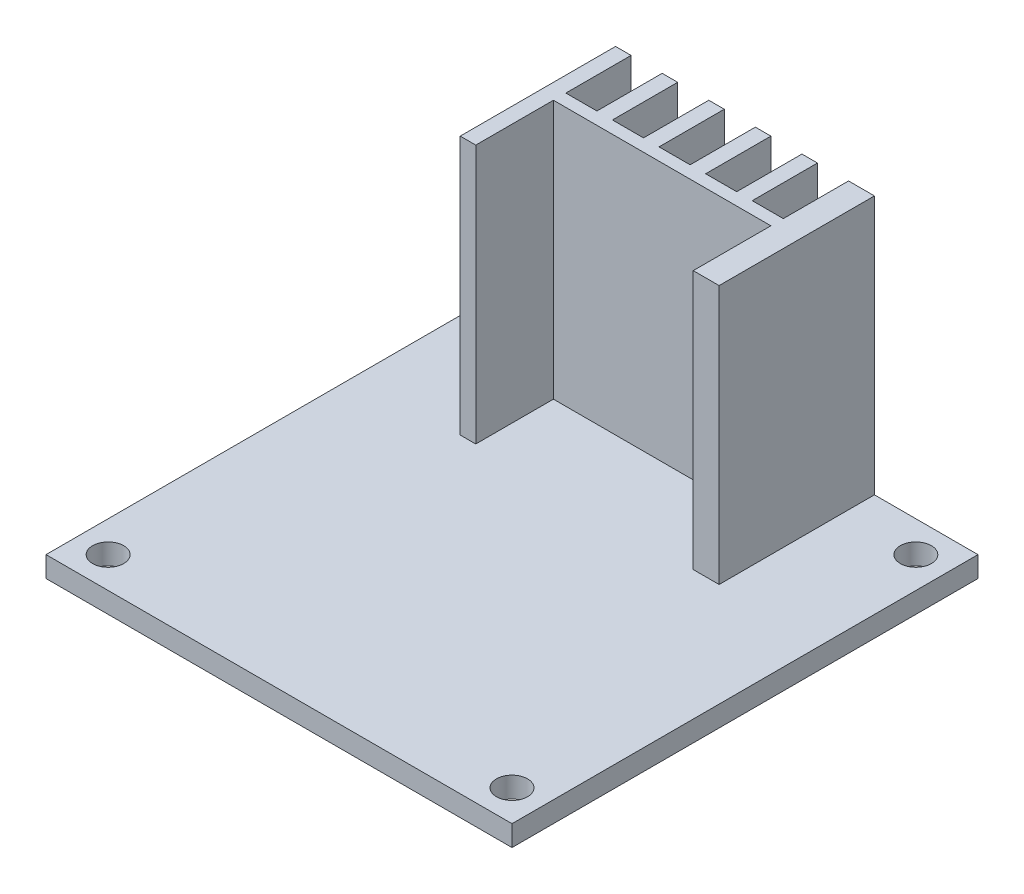
ISO-10303-21;
HEADER;
FILE_DESCRIPTION(('STEP AP214'),'2;1');
FILE_NAME('part.step','',(''),(''),'','','');
FILE_SCHEMA(('AUTOMOTIVE_DESIGN { 1 0 10303 214 1 1 1 1 }'));
ENDSEC;
DATA;
#1=APPLICATION_CONTEXT('core data for automotive mechanical design processes');
#2=APPLICATION_PROTOCOL_DEFINITION('international standard','automotive_design',2000,#1);
#3=PRODUCT_CONTEXT('',#1,'mechanical');
#4=PRODUCT('Part','Part','',(#3));
#5=PRODUCT_RELATED_PRODUCT_CATEGORY('part','',(#4));
#6=PRODUCT_DEFINITION_FORMATION('','',#4);
#7=PRODUCT_DEFINITION_CONTEXT('part definition',#1,'design');
#8=PRODUCT_DEFINITION('design','',#6,#7);
#9=PRODUCT_DEFINITION_SHAPE('','',#8);
#10=(LENGTH_UNIT() NAMED_UNIT(*) SI_UNIT(.MILLI.,.METRE.));
#11=(NAMED_UNIT(*) PLANE_ANGLE_UNIT() SI_UNIT($,.RADIAN.));
#12=(NAMED_UNIT(*) SI_UNIT($,.STERADIAN.) SOLID_ANGLE_UNIT());
#13=UNCERTAINTY_MEASURE_WITH_UNIT(LENGTH_MEASURE(1.E-05),#10,'distance_accuracy_value','');
#14=(GEOMETRIC_REPRESENTATION_CONTEXT(3) GLOBAL_UNCERTAINTY_ASSIGNED_CONTEXT((#13)) GLOBAL_UNIT_ASSIGNED_CONTEXT((#10,
#11,#12)) REPRESENTATION_CONTEXT('',''));
#15=CARTESIAN_POINT('',(0.,0.,0.));
#16=DIRECTION('',(0.,0.,1.));
#17=DIRECTION('',(1.,0.,0.));
#18=AXIS2_PLACEMENT_3D('',#15,#16,#17);
#19=CARTESIAN_POINT('',(22.5,2.,-22.5));
#20=DIRECTION('',(0.,0.,1.));
#21=DIRECTION('',(1.,0.,0.));
#22=AXIS2_PLACEMENT_3D('',#19,#20,#21);
#23=PLANE('',#22);
#24=DIRECTION('',(1.,0.,0.));
#25=VECTOR('',#24,1.);
#26=CARTESIAN_POINT('',(22.5,2.,-22.5));
#27=LINE('',#26,#25);
#28=CARTESIAN_POINT('',(-12.5,2.,-22.5));
#29=VERTEX_POINT('',#28);
#30=CARTESIAN_POINT('',(-11.,2.,-22.5));
#31=VERTEX_POINT('',#30);
#32=EDGE_CURVE('E11',#29,#31,#27,.T.);
#33=ORIENTED_EDGE('',*,*,#32,.F.);
#34=DIRECTION('',(0.,-1.,0.));
#35=VECTOR('',#34,1.);
#36=CARTESIAN_POINT('',(-12.5,27.,-22.5));
#37=LINE('',#36,#35);
#38=CARTESIAN_POINT('',(-12.5,27.,-22.5));
#39=VERTEX_POINT('',#38);
#40=EDGE_CURVE('E703',#39,#29,#37,.T.);
#41=ORIENTED_EDGE('',*,*,#40,.F.);
#42=DIRECTION('',(-1.,0.,0.));
#43=VECTOR('',#42,1.);
#44=CARTESIAN_POINT('',(0.,27.,-22.5));
#45=LINE('',#44,#43);
#46=CARTESIAN_POINT('',(-11.,27.,-22.5));
#47=VERTEX_POINT('',#46);
#48=EDGE_CURVE('E290',#47,#39,#45,.T.);
#49=ORIENTED_EDGE('',*,*,#48,.F.);
#50=DIRECTION('',(0.,-1.,0.));
#51=VECTOR('',#50,1.);
#52=CARTESIAN_POINT('',(-11.,27.,-22.5));
#53=LINE('',#52,#51);
#54=EDGE_CURVE('E452',#47,#31,#53,.T.);
#55=ORIENTED_EDGE('',*,*,#54,.T.);
#56=EDGE_LOOP('',(#33,#41,#49,#55));
#57=FACE_BOUND('',#56,.T.);
#58=ADVANCED_FACE('F38',(#57),#23,.F.);
#59=CARTESIAN_POINT('',(-7.99999999999999,2.,-22.5));
#60=VERTEX_POINT('',#59);
#61=CARTESIAN_POINT('',(-6.49999999999998,2.,-22.5));
#62=VERTEX_POINT('',#61);
#63=EDGE_CURVE('E48',#60,#62,#27,.T.);
#64=ORIENTED_EDGE('',*,*,#63,.F.);
#65=DIRECTION('',(0.,-1.,0.));
#66=VECTOR('',#65,1.);
#67=CARTESIAN_POINT('',(-8.,27.,-22.5));
#68=LINE('',#67,#66);
#69=CARTESIAN_POINT('',(-8.,27.,-22.5));
#70=VERTEX_POINT('',#69);
#71=EDGE_CURVE('E416',#70,#60,#68,.T.);
#72=ORIENTED_EDGE('',*,*,#71,.F.);
#73=CARTESIAN_POINT('',(-6.5,27.,-22.5));
#74=VERTEX_POINT('',#73);
#75=EDGE_CURVE('E329',#74,#70,#45,.T.);
#76=ORIENTED_EDGE('',*,*,#75,.F.);
#77=DIRECTION('',(0.,-1.,0.));
#78=VECTOR('',#77,1.);
#79=CARTESIAN_POINT('',(-6.5,27.,-22.5));
#80=LINE('',#79,#78);
#81=EDGE_CURVE('E411',#74,#62,#80,.T.);
#82=ORIENTED_EDGE('',*,*,#81,.T.);
#83=EDGE_LOOP('',(#64,#72,#76,#82));
#84=FACE_BOUND('',#83,.T.);
#85=ADVANCED_FACE('F412',(#84),#23,.F.);
#86=CARTESIAN_POINT('',(-3.49999999999999,2.,-22.5));
#87=VERTEX_POINT('',#86);
#88=CARTESIAN_POINT('',(-1.99999999999998,2.,-22.5));
#89=VERTEX_POINT('',#88);
#90=EDGE_CURVE('E381',#87,#89,#27,.T.);
#91=ORIENTED_EDGE('',*,*,#90,.F.);
#92=DIRECTION('',(0.,-1.,0.));
#93=VECTOR('',#92,1.);
#94=CARTESIAN_POINT('',(-3.5,27.,-22.5));
#95=LINE('',#94,#93);
#96=CARTESIAN_POINT('',(-3.5,27.,-22.5));
#97=VERTEX_POINT('',#96);
#98=EDGE_CURVE('E458',#97,#87,#95,.T.);
#99=ORIENTED_EDGE('',*,*,#98,.F.);
#100=CARTESIAN_POINT('',(-2.,27.,-22.5));
#101=VERTEX_POINT('',#100);
#102=EDGE_CURVE('E319',#101,#97,#45,.T.);
#103=ORIENTED_EDGE('',*,*,#102,.F.);
#104=DIRECTION('',(0.,-1.,0.));
#105=VECTOR('',#104,1.);
#106=CARTESIAN_POINT('',(-2.,27.,-22.5));
#107=LINE('',#106,#105);
#108=EDGE_CURVE('E463',#101,#89,#107,.T.);
#109=ORIENTED_EDGE('',*,*,#108,.T.);
#110=EDGE_LOOP('',(#91,#99,#103,#109));
#111=FACE_BOUND('',#110,.T.);
#112=ADVANCED_FACE('F609',(#111),#23,.F.);
#113=CARTESIAN_POINT('',(1.00000000000001,2.,-22.5));
#114=VERTEX_POINT('',#113);
#115=CARTESIAN_POINT('',(2.50000000000002,2.,-22.5));
#116=VERTEX_POINT('',#115);
#117=EDGE_CURVE('E378',#114,#116,#27,.T.);
#118=ORIENTED_EDGE('',*,*,#117,.F.);
#119=DIRECTION('',(0.,-1.,0.));
#120=VECTOR('',#119,1.);
#121=CARTESIAN_POINT('',(1.,27.,-22.5));
#122=LINE('',#121,#120);
#123=CARTESIAN_POINT('',(1.,27.,-22.5));
#124=VERTEX_POINT('',#123);
#125=EDGE_CURVE('E466',#124,#114,#122,.T.);
#126=ORIENTED_EDGE('',*,*,#125,.F.);
#127=CARTESIAN_POINT('',(2.5,27.,-22.5));
#128=VERTEX_POINT('',#127);
#129=EDGE_CURVE('E309',#128,#124,#45,.T.);
#130=ORIENTED_EDGE('',*,*,#129,.F.);
#131=DIRECTION('',(0.,-1.,0.));
#132=VECTOR('',#131,1.);
#133=CARTESIAN_POINT('',(2.5,27.,-22.5));
#134=LINE('',#133,#132);
#135=EDGE_CURVE('E471',#128,#116,#134,.T.);
#136=ORIENTED_EDGE('',*,*,#135,.T.);
#137=EDGE_LOOP('',(#118,#126,#130,#136));
#138=FACE_BOUND('',#137,.T.);
#139=ADVANCED_FACE('F629',(#138),#23,.F.);
#140=CARTESIAN_POINT('',(5.50000000000002,2.,-22.5));
#141=VERTEX_POINT('',#140);
#142=CARTESIAN_POINT('',(7.00000000000001,2.,-22.5));
#143=VERTEX_POINT('',#142);
#144=EDGE_CURVE('E374',#141,#143,#27,.T.);
#145=ORIENTED_EDGE('',*,*,#144,.F.);
#146=DIRECTION('',(0.,-1.,0.));
#147=VECTOR('',#146,1.);
#148=CARTESIAN_POINT('',(5.5,27.,-22.5));
#149=LINE('',#148,#147);
#150=CARTESIAN_POINT('',(5.5,27.,-22.5));
#151=VERTEX_POINT('',#150);
#152=EDGE_CURVE('E474',#151,#141,#149,.T.);
#153=ORIENTED_EDGE('',*,*,#152,.F.);
#154=CARTESIAN_POINT('',(7.,27.,-22.5));
#155=VERTEX_POINT('',#154);
#156=EDGE_CURVE('E291',#155,#151,#45,.T.);
#157=ORIENTED_EDGE('',*,*,#156,.F.);
#158=DIRECTION('',(0.,-1.,0.));
#159=VECTOR('',#158,1.);
#160=CARTESIAN_POINT('',(7.,27.,-22.5));
#161=LINE('',#160,#159);
#162=EDGE_CURVE('E479',#155,#143,#161,.T.);
#163=ORIENTED_EDGE('',*,*,#162,.T.);
#164=EDGE_LOOP('',(#145,#153,#157,#163));
#165=FACE_BOUND('',#164,.T.);
#166=ADVANCED_FACE('F622',(#165),#23,.F.);
#167=CARTESIAN_POINT('',(10.,2.,-22.5));
#168=VERTEX_POINT('',#167);
#169=CARTESIAN_POINT('',(12.5,2.,-22.5));
#170=VERTEX_POINT('',#169);
#171=EDGE_CURVE('E371',#168,#170,#27,.T.);
#172=ORIENTED_EDGE('',*,*,#171,.F.);
#173=DIRECTION('',(0.,-1.,0.));
#174=VECTOR('',#173,1.);
#175=CARTESIAN_POINT('',(10.,27.,-22.5));
#176=LINE('',#175,#174);
#177=CARTESIAN_POINT('',(10.,27.,-22.5));
#178=VERTEX_POINT('',#177);
#179=EDGE_CURVE('E368',#178,#168,#176,.T.);
#180=ORIENTED_EDGE('',*,*,#179,.F.);
#181=CARTESIAN_POINT('',(12.5,27.,-22.5));
#182=VERTEX_POINT('',#181);
#183=EDGE_CURVE('E287',#182,#178,#45,.T.);
#184=ORIENTED_EDGE('',*,*,#183,.F.);
#185=DIRECTION('',(0.,-1.,0.));
#186=VECTOR('',#185,1.);
#187=CARTESIAN_POINT('',(12.5,27.,-22.5));
#188=LINE('',#187,#186);
#189=EDGE_CURVE('E364',#182,#170,#188,.T.);
#190=ORIENTED_EDGE('',*,*,#189,.T.);
#191=EDGE_LOOP('',(#172,#180,#184,#190));
#192=FACE_BOUND('',#191,.T.);
#193=ADVANCED_FACE('F613',(#192),#23,.F.);
#194=CARTESIAN_POINT('',(0.,2.,0.));
#195=DIRECTION('',(0.,1.,0.));
#196=DIRECTION('',(0.,0.,1.));
#197=AXIS2_PLACEMENT_3D('',#194,#195,#196);
#198=PLANE('',#197);
#199=DIRECTION('',(-1.,0.,0.));
#200=VECTOR('',#199,1.);
#201=CARTESIAN_POINT('',(22.5,2.,-22.5));
#202=LINE('',#201,#200);
#203=EDGE_CURVE('E395',#60,#31,#202,.T.);
#204=ORIENTED_EDGE('',*,*,#203,.T.);
#205=DIRECTION('',(0.,0.,1.));
#206=VECTOR('',#205,1.);
#207=CARTESIAN_POINT('',(-11.,2.,0.));
#208=LINE('',#207,#206);
#209=CARTESIAN_POINT('',(-11.,2.,-16.2));
#210=VERTEX_POINT('',#209);
#211=EDGE_CURVE('E55',#31,#210,#208,.T.);
#212=ORIENTED_EDGE('',*,*,#211,.T.);
#213=DIRECTION('',(1.,0.,0.));
#214=VECTOR('',#213,1.);
#215=CARTESIAN_POINT('',(0.,2.,-16.2));
#216=LINE('',#215,#214);
#217=CARTESIAN_POINT('',(-8.,2.,-16.2));
#218=VERTEX_POINT('',#217);
#219=EDGE_CURVE('E60',#210,#218,#216,.T.);
#220=ORIENTED_EDGE('',*,*,#219,.T.);
#221=DIRECTION('',(0.,0.,-1.));
#222=VECTOR('',#221,1.);
#223=CARTESIAN_POINT('',(-8.,2.,0.));
#224=LINE('',#223,#222);
#225=EDGE_CURVE('E420',#218,#60,#224,.T.);
#226=ORIENTED_EDGE('',*,*,#225,.T.);
#227=EDGE_LOOP('',(#204,#212,#220,#226));
#228=FACE_BOUND('',#227,.T.);
#229=ADVANCED_FACE('F621',(#228),#198,.T.);
#230=EDGE_CURVE('E393',#87,#62,#202,.T.);
#231=ORIENTED_EDGE('',*,*,#230,.T.);
#232=DIRECTION('',(0.,0.,1.));
#233=VECTOR('',#232,1.);
#234=CARTESIAN_POINT('',(-6.5,2.,0.));
#235=LINE('',#234,#233);
#236=CARTESIAN_POINT('',(-6.5,2.,-16.2));
#237=VERTEX_POINT('',#236);
#238=EDGE_CURVE('E404',#62,#237,#235,.T.);
#239=ORIENTED_EDGE('',*,*,#238,.T.);
#240=DIRECTION('',(1.,0.,0.));
#241=VECTOR('',#240,1.);
#242=CARTESIAN_POINT('',(0.,2.,-16.2));
#243=LINE('',#242,#241);
#244=CARTESIAN_POINT('',(-3.5,2.,-16.2));
#245=VERTEX_POINT('',#244);
#246=EDGE_CURVE('E421',#237,#245,#243,.T.);
#247=ORIENTED_EDGE('',*,*,#246,.T.);
#248=DIRECTION('',(0.,0.,-1.));
#249=VECTOR('',#248,1.);
#250=CARTESIAN_POINT('',(-3.5,2.,0.));
#251=LINE('',#250,#249);
#252=EDGE_CURVE('E407',#245,#87,#251,.T.);
#253=ORIENTED_EDGE('',*,*,#252,.T.);
#254=EDGE_LOOP('',(#231,#239,#247,#253));
#255=FACE_BOUND('',#254,.T.);
#256=ADVANCED_FACE('F402',(#255),#198,.T.);
#257=EDGE_CURVE('E408',#114,#89,#202,.T.);
#258=ORIENTED_EDGE('',*,*,#257,.T.);
#259=DIRECTION('',(0.,0.,1.));
#260=VECTOR('',#259,1.);
#261=CARTESIAN_POINT('',(-2.,2.,0.));
#262=LINE('',#261,#260);
#263=CARTESIAN_POINT('',(-2.,2.,-16.2));
#264=VERTEX_POINT('',#263);
#265=EDGE_CURVE('E955',#89,#264,#262,.T.);
#266=ORIENTED_EDGE('',*,*,#265,.T.);
#267=DIRECTION('',(1.,0.,0.));
#268=VECTOR('',#267,1.);
#269=CARTESIAN_POINT('',(0.,2.,-16.2));
#270=LINE('',#269,#268);
#271=CARTESIAN_POINT('',(1.,2.,-16.2));
#272=VERTEX_POINT('',#271);
#273=EDGE_CURVE('E665',#264,#272,#270,.T.);
#274=ORIENTED_EDGE('',*,*,#273,.T.);
#275=DIRECTION('',(0.,0.,-1.));
#276=VECTOR('',#275,1.);
#277=CARTESIAN_POINT('',(1.,2.,0.));
#278=LINE('',#277,#276);
#279=EDGE_CURVE('E669',#272,#114,#278,.T.);
#280=ORIENTED_EDGE('',*,*,#279,.T.);
#281=EDGE_LOOP('',(#258,#266,#274,#280));
#282=FACE_BOUND('',#281,.T.);
#283=ADVANCED_FACE('F944',(#282),#198,.T.);
#284=EDGE_CURVE('E541',#141,#116,#202,.T.);
#285=ORIENTED_EDGE('',*,*,#284,.T.);
#286=DIRECTION('',(0.,0.,1.));
#287=VECTOR('',#286,1.);
#288=CARTESIAN_POINT('',(2.50000000000001,2.,0.));
#289=LINE('',#288,#287);
#290=CARTESIAN_POINT('',(2.5,2.,-16.2));
#291=VERTEX_POINT('',#290);
#292=EDGE_CURVE('E662',#116,#291,#289,.T.);
#293=ORIENTED_EDGE('',*,*,#292,.T.);
#294=DIRECTION('',(1.,0.,0.));
#295=VECTOR('',#294,1.);
#296=CARTESIAN_POINT('',(0.,2.,-16.2));
#297=LINE('',#296,#295);
#298=CARTESIAN_POINT('',(5.5,2.,-16.2));
#299=VERTEX_POINT('',#298);
#300=EDGE_CURVE('E660',#291,#299,#297,.T.);
#301=ORIENTED_EDGE('',*,*,#300,.T.);
#302=DIRECTION('',(0.,0.,-1.));
#303=VECTOR('',#302,1.);
#304=CARTESIAN_POINT('',(5.5,2.,0.));
#305=LINE('',#304,#303);
#306=EDGE_CURVE('E655',#299,#141,#305,.T.);
#307=ORIENTED_EDGE('',*,*,#306,.T.);
#308=EDGE_LOOP('',(#285,#293,#301,#307));
#309=FACE_BOUND('',#308,.T.);
#310=ADVANCED_FACE('F978',(#309),#198,.T.);
#311=EDGE_CURVE('E538',#168,#143,#202,.T.);
#312=ORIENTED_EDGE('',*,*,#311,.T.);
#313=DIRECTION('',(0.,0.,1.));
#314=VECTOR('',#313,1.);
#315=CARTESIAN_POINT('',(7.,2.,0.));
#316=LINE('',#315,#314);
#317=CARTESIAN_POINT('',(7.,2.,-16.2));
#318=VERTEX_POINT('',#317);
#319=EDGE_CURVE('E653',#143,#318,#316,.T.);
#320=ORIENTED_EDGE('',*,*,#319,.T.);
#321=DIRECTION('',(1.,0.,0.));
#322=VECTOR('',#321,1.);
#323=CARTESIAN_POINT('',(0.,2.,-16.2));
#324=LINE('',#323,#322);
#325=CARTESIAN_POINT('',(10.,2.,-16.2));
#326=VERTEX_POINT('',#325);
#327=EDGE_CURVE('E355',#318,#326,#324,.T.);
#328=ORIENTED_EDGE('',*,*,#327,.T.);
#329=DIRECTION('',(0.,0.,-1.));
#330=VECTOR('',#329,1.);
#331=CARTESIAN_POINT('',(10.,2.,0.));
#332=LINE('',#331,#330);
#333=EDGE_CURVE('E361',#326,#168,#332,.T.);
#334=ORIENTED_EDGE('',*,*,#333,.T.);
#335=EDGE_LOOP('',(#312,#320,#328,#334));
#336=FACE_BOUND('',#335,.T.);
#337=ADVANCED_FACE('F642',(#336),#198,.T.);
#338=CARTESIAN_POINT('',(-19.5,2.,19.5));
#339=DIRECTION('',(0.,1.,0.));
#340=DIRECTION('',(0.,0.,1.));
#341=AXIS2_PLACEMENT_3D('',#338,#339,#340);
#342=CIRCLE('',#341,1.5);
#343=CARTESIAN_POINT('',(-19.5,2.,21.));
#344=VERTEX_POINT('',#343);
#345=EDGE_CURVE('E497',#344,#344,#342,.T.);
#346=ORIENTED_EDGE('',*,*,#345,.F.);
#347=EDGE_LOOP('',(#346));
#348=FACE_BOUND('',#347,.T.);
#349=CARTESIAN_POINT('',(-19.5,2.,-19.5));
#350=DIRECTION('',(0.,1.,0.));
#351=DIRECTION('',(0.,0.,1.));
#352=AXIS2_PLACEMENT_3D('',#349,#350,#351);
#353=CIRCLE('',#352,1.5);
#354=CARTESIAN_POINT('',(-19.5,2.,-18.));
#355=VERTEX_POINT('',#354);
#356=EDGE_CURVE('E509',#355,#355,#353,.T.);
#357=ORIENTED_EDGE('',*,*,#356,.F.);
#358=EDGE_LOOP('',(#357));
#359=FACE_BOUND('',#358,.T.);
#360=CARTESIAN_POINT('',(19.5,2.,-19.5));
#361=DIRECTION('',(0.,1.,0.));
#362=DIRECTION('',(0.,0.,1.));
#363=AXIS2_PLACEMENT_3D('',#360,#361,#362);
#364=CIRCLE('',#363,1.5);
#365=CARTESIAN_POINT('',(19.5,2.,-18.));
#366=VERTEX_POINT('',#365);
#367=EDGE_CURVE('E503',#366,#366,#364,.T.);
#368=ORIENTED_EDGE('',*,*,#367,.F.);
#369=EDGE_LOOP('',(#368));
#370=FACE_BOUND('',#369,.T.);
#371=CARTESIAN_POINT('',(19.5,2.,19.5));
#372=DIRECTION('',(0.,1.,0.));
#373=DIRECTION('',(0.,0.,1.));
#374=AXIS2_PLACEMENT_3D('',#371,#372,#373);
#375=CIRCLE('',#374,1.5);
#376=CARTESIAN_POINT('',(19.5,2.,21.));
#377=VERTEX_POINT('',#376);
#378=EDGE_CURVE('E491',#377,#377,#375,.T.);
#379=ORIENTED_EDGE('',*,*,#378,.F.);
#380=EDGE_LOOP('',(#379));
#381=FACE_BOUND('',#380,.T.);
#382=DIRECTION('',(-1.,0.,0.));
#383=VECTOR('',#382,1.);
#384=CARTESIAN_POINT('',(0.,2.,-7.5));
#385=LINE('',#384,#383);
#386=CARTESIAN_POINT('',(-11.,2.,-7.5));
#387=VERTEX_POINT('',#386);
#388=CARTESIAN_POINT('',(-12.5,2.,-7.5));
#389=VERTEX_POINT('',#388);
#390=EDGE_CURVE('E257',#387,#389,#385,.T.);
#391=ORIENTED_EDGE('',*,*,#390,.T.);
#392=DIRECTION('',(0.,0.,-1.));
#393=VECTOR('',#392,1.);
#394=CARTESIAN_POINT('',(-12.5,2.,0.));
#395=LINE('',#394,#393);
#396=EDGE_CURVE('E274',#389,#29,#395,.T.);
#397=ORIENTED_EDGE('',*,*,#396,.T.);
#398=CARTESIAN_POINT('',(-22.5,2.,-22.5));
#399=VERTEX_POINT('',#398);
#400=EDGE_CURVE('E523',#29,#399,#202,.T.);
#401=ORIENTED_EDGE('',*,*,#400,.T.);
#402=DIRECTION('',(0.,0.,1.));
#403=VECTOR('',#402,1.);
#404=CARTESIAN_POINT('',(-22.5,2.,22.5));
#405=LINE('',#404,#403);
#406=CARTESIAN_POINT('',(-22.5,2.,22.5));
#407=VERTEX_POINT('',#406);
#408=EDGE_CURVE('E515',#399,#407,#405,.T.);
#409=ORIENTED_EDGE('',*,*,#408,.T.);
#410=DIRECTION('',(1.,0.,0.));
#411=VECTOR('',#410,1.);
#412=CARTESIAN_POINT('',(22.5,2.,22.5));
#413=LINE('',#412,#411);
#414=CARTESIAN_POINT('',(22.5,2.,22.5));
#415=VERTEX_POINT('',#414);
#416=EDGE_CURVE('E518',#407,#415,#413,.T.);
#417=ORIENTED_EDGE('',*,*,#416,.T.);
#418=DIRECTION('',(0.,0.,-1.));
#419=VECTOR('',#418,1.);
#420=CARTESIAN_POINT('',(22.5,2.,22.5));
#421=LINE('',#420,#419);
#422=CARTESIAN_POINT('',(22.5,2.,-22.5));
#423=VERTEX_POINT('',#422);
#424=EDGE_CURVE('E521',#415,#423,#421,.T.);
#425=ORIENTED_EDGE('',*,*,#424,.T.);
#426=EDGE_CURVE('E534',#423,#170,#202,.T.);
#427=ORIENTED_EDGE('',*,*,#426,.T.);
#428=DIRECTION('',(0.,0.,-1.));
#429=VECTOR('',#428,1.);
#430=CARTESIAN_POINT('',(12.5,2.,0.));
#431=LINE('',#430,#429);
#432=CARTESIAN_POINT('',(12.5,2.,-7.50000000000001));
#433=VERTEX_POINT('',#432);
#434=EDGE_CURVE('E352',#433,#170,#431,.T.);
#435=ORIENTED_EDGE('',*,*,#434,.F.);
#436=DIRECTION('',(-1.,0.,0.));
#437=VECTOR('',#436,1.);
#438=CARTESIAN_POINT('',(0.,2.,-7.50000000000001));
#439=LINE('',#438,#437);
#440=CARTESIAN_POINT('',(10.,2.,-7.50000000000001));
#441=VERTEX_POINT('',#440);
#442=EDGE_CURVE('E350',#433,#441,#439,.T.);
#443=ORIENTED_EDGE('',*,*,#442,.T.);
#444=DIRECTION('',(0.,0.,1.));
#445=VECTOR('',#444,1.);
#446=CARTESIAN_POINT('',(10.,2.,0.));
#447=LINE('',#446,#445);
#448=CARTESIAN_POINT('',(10.,2.,-15.));
#449=VERTEX_POINT('',#448);
#450=EDGE_CURVE('E347',#449,#441,#447,.T.);
#451=ORIENTED_EDGE('',*,*,#450,.F.);
#452=DIRECTION('',(1.,0.,0.));
#453=VECTOR('',#452,1.);
#454=CARTESIAN_POINT('',(0.,2.,-15.));
#455=LINE('',#454,#453);
#456=CARTESIAN_POINT('',(-11.,2.,-15.));
#457=VERTEX_POINT('',#456);
#458=EDGE_CURVE('E344',#457,#449,#455,.T.);
#459=ORIENTED_EDGE('',*,*,#458,.F.);
#460=DIRECTION('',(0.,0.,-1.));
#461=VECTOR('',#460,1.);
#462=CARTESIAN_POINT('',(-11.,2.,0.));
#463=LINE('',#462,#461);
#464=EDGE_CURVE('E342',#387,#457,#463,.T.);
#465=ORIENTED_EDGE('',*,*,#464,.F.);
#466=EDGE_LOOP('',(#391,#397,#401,#409,#417,#425,#427,#435,#443,#451,#459,#465));
#467=FACE_BOUND('',#466,.T.);
#468=ADVANCED_FACE('F546',(#348,#359,#370,#381,#467),#198,.T.);
#469=CARTESIAN_POINT('',(0.,0.,0.));
#470=DIRECTION('',(0.,1.,0.));
#471=DIRECTION('',(0.,0.,1.));
#472=AXIS2_PLACEMENT_3D('',#469,#470,#471);
#473=PLANE('',#472);
#474=DIRECTION('',(0.,0.,1.));
#475=VECTOR('',#474,1.);
#476=CARTESIAN_POINT('',(-22.5,0.,22.5));
#477=LINE('',#476,#475);
#478=CARTESIAN_POINT('',(-22.5,0.,-22.5));
#479=VERTEX_POINT('',#478);
#480=CARTESIAN_POINT('',(-22.5,0.,22.5));
#481=VERTEX_POINT('',#480);
#482=EDGE_CURVE('E512',#479,#481,#477,.T.);
#483=ORIENTED_EDGE('',*,*,#482,.F.);
#484=DIRECTION('',(-1.,0.,0.));
#485=VECTOR('',#484,1.);
#486=CARTESIAN_POINT('',(22.5,0.,-22.5));
#487=LINE('',#486,#485);
#488=CARTESIAN_POINT('',(22.5,0.,-22.5));
#489=VERTEX_POINT('',#488);
#490=EDGE_CURVE('E519',#489,#479,#487,.T.);
#491=ORIENTED_EDGE('',*,*,#490,.F.);
#492=DIRECTION('',(0.,0.,-1.));
#493=VECTOR('',#492,1.);
#494=CARTESIAN_POINT('',(22.5,0.,22.5));
#495=LINE('',#494,#493);
#496=CARTESIAN_POINT('',(22.5,0.,22.5));
#497=VERTEX_POINT('',#496);
#498=EDGE_CURVE('E568',#497,#489,#495,.T.);
#499=ORIENTED_EDGE('',*,*,#498,.F.);
#500=DIRECTION('',(1.,0.,0.));
#501=VECTOR('',#500,1.);
#502=CARTESIAN_POINT('',(22.5,0.,22.5));
#503=LINE('',#502,#501);
#504=EDGE_CURVE('E569',#481,#497,#503,.T.);
#505=ORIENTED_EDGE('',*,*,#504,.F.);
#506=EDGE_LOOP('',(#483,#491,#499,#505));
#507=FACE_BOUND('',#506,.T.);
#508=CARTESIAN_POINT('',(-19.5,0.,-19.5));
#509=DIRECTION('',(0.,1.,0.));
#510=DIRECTION('',(0.,0.,1.));
#511=AXIS2_PLACEMENT_3D('',#508,#509,#510);
#512=CIRCLE('',#511,1.5);
#513=CARTESIAN_POINT('',(-19.5,0.,-18.));
#514=VERTEX_POINT('',#513);
#515=EDGE_CURVE('E506',#514,#514,#512,.T.);
#516=ORIENTED_EDGE('',*,*,#515,.T.);
#517=EDGE_LOOP('',(#516));
#518=FACE_BOUND('',#517,.T.);
#519=CARTESIAN_POINT('',(19.5,0.,-19.5));
#520=DIRECTION('',(0.,1.,0.));
#521=DIRECTION('',(0.,0.,1.));
#522=AXIS2_PLACEMENT_3D('',#519,#520,#521);
#523=CIRCLE('',#522,1.5);
#524=CARTESIAN_POINT('',(19.5,0.,-18.));
#525=VERTEX_POINT('',#524);
#526=EDGE_CURVE('E500',#525,#525,#523,.T.);
#527=ORIENTED_EDGE('',*,*,#526,.T.);
#528=EDGE_LOOP('',(#527));
#529=FACE_BOUND('',#528,.T.);
#530=CARTESIAN_POINT('',(-19.5,0.,19.5));
#531=DIRECTION('',(0.,1.,0.));
#532=DIRECTION('',(0.,0.,1.));
#533=AXIS2_PLACEMENT_3D('',#530,#531,#532);
#534=CIRCLE('',#533,1.5);
#535=CARTESIAN_POINT('',(-19.5,0.,21.));
#536=VERTEX_POINT('',#535);
#537=EDGE_CURVE('E494',#536,#536,#534,.T.);
#538=ORIENTED_EDGE('',*,*,#537,.T.);
#539=EDGE_LOOP('',(#538));
#540=FACE_BOUND('',#539,.T.);
#541=CARTESIAN_POINT('',(19.5,0.,19.5));
#542=DIRECTION('',(0.,1.,0.));
#543=DIRECTION('',(0.,0.,1.));
#544=AXIS2_PLACEMENT_3D('',#541,#542,#543);
#545=CIRCLE('',#544,1.5);
#546=CARTESIAN_POINT('',(19.5,0.,21.));
#547=VERTEX_POINT('',#546);
#548=EDGE_CURVE('E260',#547,#547,#545,.T.);
#549=ORIENTED_EDGE('',*,*,#548,.T.);
#550=EDGE_LOOP('',(#549));
#551=FACE_BOUND('',#550,.T.);
#552=ADVANCED_FACE('F578',(#507,#518,#529,#540,#551),#473,.F.);
#553=CARTESIAN_POINT('',(-22.5,2.,22.5));
#554=DIRECTION('',(1.,0.,0.));
#555=DIRECTION('',(0.,0.,-1.));
#556=AXIS2_PLACEMENT_3D('',#553,#554,#555);
#557=PLANE('',#556);
#558=ORIENTED_EDGE('',*,*,#482,.T.);
#559=DIRECTION('',(0.,-1.,0.));
#560=VECTOR('',#559,1.);
#561=CARTESIAN_POINT('',(-22.5,2.,22.5));
#562=LINE('',#561,#560);
#563=EDGE_CURVE('E375',#407,#481,#562,.T.);
#564=ORIENTED_EDGE('',*,*,#563,.F.);
#565=ORIENTED_EDGE('',*,*,#408,.F.);
#566=DIRECTION('',(0.,-1.,0.));
#567=VECTOR('',#566,1.);
#568=CARTESIAN_POINT('',(-22.5,2.,-22.5));
#569=LINE('',#568,#567);
#570=EDGE_CURVE('E552',#399,#479,#569,.T.);
#571=ORIENTED_EDGE('',*,*,#570,.T.);
#572=EDGE_LOOP('',(#558,#564,#565,#571));
#573=FACE_BOUND('',#572,.T.);
#574=ADVANCED_FACE('F40',(#573),#557,.F.);
#575=CARTESIAN_POINT('',(22.5,2.,22.5));
#576=DIRECTION('',(0.,0.,-1.));
#577=DIRECTION('',(-1.,0.,0.));
#578=AXIS2_PLACEMENT_3D('',#575,#576,#577);
#579=PLANE('',#578);
#580=ORIENTED_EDGE('',*,*,#504,.T.);
#581=DIRECTION('',(0.,-1.,0.));
#582=VECTOR('',#581,1.);
#583=CARTESIAN_POINT('',(22.5,2.,22.5));
#584=LINE('',#583,#582);
#585=EDGE_CURVE('E562',#415,#497,#584,.T.);
#586=ORIENTED_EDGE('',*,*,#585,.F.);
#587=ORIENTED_EDGE('',*,*,#416,.F.);
#588=ORIENTED_EDGE('',*,*,#563,.T.);
#589=EDGE_LOOP('',(#580,#586,#587,#588));
#590=FACE_BOUND('',#589,.T.);
#591=ADVANCED_FACE('F571',(#590),#579,.F.);
#592=CARTESIAN_POINT('',(22.5,2.,22.5));
#593=DIRECTION('',(-1.,0.,0.));
#594=DIRECTION('',(0.,0.,1.));
#595=AXIS2_PLACEMENT_3D('',#592,#593,#594);
#596=PLANE('',#595);
#597=ORIENTED_EDGE('',*,*,#498,.T.);
#598=DIRECTION('',(0.,-1.,0.));
#599=VECTOR('',#598,1.);
#600=CARTESIAN_POINT('',(22.5,2.,-22.5));
#601=LINE('',#600,#599);
#602=EDGE_CURVE('E558',#423,#489,#601,.T.);
#603=ORIENTED_EDGE('',*,*,#602,.F.);
#604=ORIENTED_EDGE('',*,*,#424,.F.);
#605=ORIENTED_EDGE('',*,*,#585,.T.);
#606=EDGE_LOOP('',(#597,#603,#604,#605));
#607=FACE_BOUND('',#606,.T.);
#608=ADVANCED_FACE('F576',(#607),#596,.F.);
#609=ORIENTED_EDGE('',*,*,#400,.F.);
#610=ORIENTED_EDGE('',*,*,#32,.T.);
#611=ORIENTED_EDGE('',*,*,#203,.F.);
#612=ORIENTED_EDGE('',*,*,#63,.T.);
#613=ORIENTED_EDGE('',*,*,#230,.F.);
#614=ORIENTED_EDGE('',*,*,#90,.T.);
#615=ORIENTED_EDGE('',*,*,#257,.F.);
#616=ORIENTED_EDGE('',*,*,#117,.T.);
#617=ORIENTED_EDGE('',*,*,#284,.F.);
#618=ORIENTED_EDGE('',*,*,#144,.T.);
#619=ORIENTED_EDGE('',*,*,#311,.F.);
#620=ORIENTED_EDGE('',*,*,#171,.T.);
#621=ORIENTED_EDGE('',*,*,#426,.F.);
#622=ORIENTED_EDGE('',*,*,#602,.T.);
#623=ORIENTED_EDGE('',*,*,#490,.T.);
#624=ORIENTED_EDGE('',*,*,#570,.F.);
#625=EDGE_LOOP('',(#609,#610,#611,#612,#613,#614,#615,#616,#617,#618,#619,#620,#621,#622,#623,#624));
#626=FACE_BOUND('',#625,.T.);
#627=ADVANCED_FACE('F392',(#626),#23,.F.);
#628=CARTESIAN_POINT('',(-19.5,2.,-19.5));
#629=DIRECTION('',(0.,-1.,0.));
#630=DIRECTION('',(0.,0.,-1.));
#631=AXIS2_PLACEMENT_3D('',#628,#629,#630);
#632=CYLINDRICAL_SURFACE('',#631,1.5);
#633=ORIENTED_EDGE('',*,*,#356,.T.);
#634=EDGE_LOOP('',(#633));
#635=FACE_BOUND('',#634,.T.);
#636=ORIENTED_EDGE('',*,*,#515,.F.);
#637=EDGE_LOOP('',(#636));
#638=FACE_BOUND('',#637,.T.);
#639=ADVANCED_FACE('F612',(#635,#638),#632,.F.);
#640=CARTESIAN_POINT('',(19.5,2.,-19.5));
#641=DIRECTION('',(0.,-1.,0.));
#642=DIRECTION('',(0.,0.,-1.));
#643=AXIS2_PLACEMENT_3D('',#640,#641,#642);
#644=CYLINDRICAL_SURFACE('',#643,1.5);
#645=ORIENTED_EDGE('',*,*,#367,.T.);
#646=EDGE_LOOP('',(#645));
#647=FACE_BOUND('',#646,.T.);
#648=ORIENTED_EDGE('',*,*,#526,.F.);
#649=EDGE_LOOP('',(#648));
#650=FACE_BOUND('',#649,.T.);
#651=ADVANCED_FACE('F600',(#647,#650),#644,.F.);
#652=CARTESIAN_POINT('',(-19.5,2.,19.5));
#653=DIRECTION('',(0.,-1.,0.));
#654=DIRECTION('',(0.,0.,-1.));
#655=AXIS2_PLACEMENT_3D('',#652,#653,#654);
#656=CYLINDRICAL_SURFACE('',#655,1.5);
#657=ORIENTED_EDGE('',*,*,#345,.T.);
#658=EDGE_LOOP('',(#657));
#659=FACE_BOUND('',#658,.T.);
#660=ORIENTED_EDGE('',*,*,#537,.F.);
#661=EDGE_LOOP('',(#660));
#662=FACE_BOUND('',#661,.T.);
#663=ADVANCED_FACE('F592',(#659,#662),#656,.F.);
#664=CARTESIAN_POINT('',(19.5,2.,19.5));
#665=DIRECTION('',(0.,-1.,0.));
#666=DIRECTION('',(0.,0.,-1.));
#667=AXIS2_PLACEMENT_3D('',#664,#665,#666);
#668=CYLINDRICAL_SURFACE('',#667,1.5);
#669=ORIENTED_EDGE('',*,*,#378,.T.);
#670=EDGE_LOOP('',(#669));
#671=FACE_BOUND('',#670,.T.);
#672=ORIENTED_EDGE('',*,*,#548,.F.);
#673=EDGE_LOOP('',(#672));
#674=FACE_BOUND('',#673,.T.);
#675=ADVANCED_FACE('F590',(#671,#674),#668,.F.);
#676=CARTESIAN_POINT('',(0.,27.,-7.5));
#677=DIRECTION('',(0.,0.,1.));
#678=DIRECTION('',(1.,0.,0.));
#679=AXIS2_PLACEMENT_3D('',#676,#677,#678);
#680=PLANE('',#679);
#681=ORIENTED_EDGE('',*,*,#390,.F.);
#682=DIRECTION('',(0.,-1.,0.));
#683=VECTOR('',#682,1.);
#684=CARTESIAN_POINT('',(-11.,27.,-7.5));
#685=LINE('',#684,#683);
#686=CARTESIAN_POINT('',(-11.,27.,-7.5));
#687=VERTEX_POINT('',#686);
#688=EDGE_CURVE('E250',#687,#387,#685,.T.);
#689=ORIENTED_EDGE('',*,*,#688,.F.);
#690=DIRECTION('',(-1.,0.,0.));
#691=VECTOR('',#690,1.);
#692=CARTESIAN_POINT('',(0.,27.,-7.5));
#693=LINE('',#692,#691);
#694=CARTESIAN_POINT('',(-12.5,27.,-7.5));
#695=VERTEX_POINT('',#694);
#696=EDGE_CURVE('E255',#687,#695,#693,.T.);
#697=ORIENTED_EDGE('',*,*,#696,.T.);
#698=DIRECTION('',(0.,-1.,0.));
#699=VECTOR('',#698,1.);
#700=CARTESIAN_POINT('',(-12.5,27.,-7.5));
#701=LINE('',#700,#699);
#702=EDGE_CURVE('E340',#695,#389,#701,.T.);
#703=ORIENTED_EDGE('',*,*,#702,.T.);
#704=EDGE_LOOP('',(#681,#689,#697,#703));
#705=FACE_BOUND('',#704,.T.);
#706=ADVANCED_FACE('F252',(#705),#680,.T.);
#707=CARTESIAN_POINT('',(-11.,27.,0.));
#708=DIRECTION('',(-1.,0.,0.));
#709=DIRECTION('',(0.,0.,1.));
#710=AXIS2_PLACEMENT_3D('',#707,#708,#709);
#711=PLANE('',#710);
#712=ORIENTED_EDGE('',*,*,#464,.T.);
#713=DIRECTION('',(0.,-1.,0.));
#714=VECTOR('',#713,1.);
#715=CARTESIAN_POINT('',(-11.,27.,-15.));
#716=LINE('',#715,#714);
#717=CARTESIAN_POINT('',(-11.,27.,-15.));
#718=VERTEX_POINT('',#717);
#719=EDGE_CURVE('E261',#718,#457,#716,.T.);
#720=ORIENTED_EDGE('',*,*,#719,.F.);
#721=DIRECTION('',(0.,0.,-1.));
#722=VECTOR('',#721,1.);
#723=CARTESIAN_POINT('',(-11.,27.,0.));
#724=LINE('',#723,#722);
#725=EDGE_CURVE('E264',#687,#718,#724,.T.);
#726=ORIENTED_EDGE('',*,*,#725,.F.);
#727=ORIENTED_EDGE('',*,*,#688,.T.);
#728=EDGE_LOOP('',(#712,#720,#726,#727));
#729=FACE_BOUND('',#728,.T.);
#730=ADVANCED_FACE('F265',(#729),#711,.F.);
#731=CARTESIAN_POINT('',(0.,27.,-15.));
#732=DIRECTION('',(0.,0.,-1.));
#733=DIRECTION('',(-1.,0.,0.));
#734=AXIS2_PLACEMENT_3D('',#731,#732,#733);
#735=PLANE('',#734);
#736=ORIENTED_EDGE('',*,*,#458,.T.);
#737=DIRECTION('',(0.,-1.,0.));
#738=VECTOR('',#737,1.);
#739=CARTESIAN_POINT('',(10.,27.,-15.));
#740=LINE('',#739,#738);
#741=CARTESIAN_POINT('',(10.,27.,-15.));
#742=VERTEX_POINT('',#741);
#743=EDGE_CURVE('E487',#742,#449,#740,.T.);
#744=ORIENTED_EDGE('',*,*,#743,.F.);
#745=DIRECTION('',(1.,0.,0.));
#746=VECTOR('',#745,1.);
#747=CARTESIAN_POINT('',(0.,27.,-15.));
#748=LINE('',#747,#746);
#749=EDGE_CURVE('E269',#718,#742,#748,.T.);
#750=ORIENTED_EDGE('',*,*,#749,.F.);
#751=ORIENTED_EDGE('',*,*,#719,.T.);
#752=EDGE_LOOP('',(#736,#744,#750,#751));
#753=FACE_BOUND('',#752,.T.);
#754=ADVANCED_FACE('F701',(#753),#735,.F.);
#755=CARTESIAN_POINT('',(10.,27.,0.));
#756=DIRECTION('',(1.,0.,0.));
#757=DIRECTION('',(0.,0.,-1.));
#758=AXIS2_PLACEMENT_3D('',#755,#756,#757);
#759=PLANE('',#758);
#760=ORIENTED_EDGE('',*,*,#450,.T.);
#761=DIRECTION('',(0.,-1.,0.));
#762=VECTOR('',#761,1.);
#763=CARTESIAN_POINT('',(10.,27.,-7.50000000000001));
#764=LINE('',#763,#762);
#765=CARTESIAN_POINT('',(10.,27.,-7.50000000000001));
#766=VERTEX_POINT('',#765);
#767=EDGE_CURVE('E484',#766,#441,#764,.T.);
#768=ORIENTED_EDGE('',*,*,#767,.F.);
#769=DIRECTION('',(0.,0.,1.));
#770=VECTOR('',#769,1.);
#771=CARTESIAN_POINT('',(10.,27.,0.));
#772=LINE('',#771,#770);
#773=EDGE_CURVE('E280',#742,#766,#772,.T.);
#774=ORIENTED_EDGE('',*,*,#773,.F.);
#775=ORIENTED_EDGE('',*,*,#743,.T.);
#776=EDGE_LOOP('',(#760,#768,#774,#775));
#777=FACE_BOUND('',#776,.T.);
#778=ADVANCED_FACE('F698',(#777),#759,.F.);
#779=CARTESIAN_POINT('',(0.,27.,-7.50000000000001));
#780=DIRECTION('',(0.,0.,1.));
#781=DIRECTION('',(1.,0.,0.));
#782=AXIS2_PLACEMENT_3D('',#779,#780,#781);
#783=PLANE('',#782);
#784=ORIENTED_EDGE('',*,*,#442,.F.);
#785=DIRECTION('',(0.,-1.,0.));
#786=VECTOR('',#785,1.);
#787=CARTESIAN_POINT('',(12.5,27.,-7.50000000000001));
#788=LINE('',#787,#786);
#789=CARTESIAN_POINT('',(12.5,27.,-7.50000000000001));
#790=VERTEX_POINT('',#789);
#791=EDGE_CURVE('E367',#790,#433,#788,.T.);
#792=ORIENTED_EDGE('',*,*,#791,.F.);
#793=DIRECTION('',(-1.,0.,0.));
#794=VECTOR('',#793,1.);
#795=CARTESIAN_POINT('',(0.,27.,-7.50000000000001));
#796=LINE('',#795,#794);
#797=EDGE_CURVE('E282',#790,#766,#796,.T.);
#798=ORIENTED_EDGE('',*,*,#797,.T.);
#799=ORIENTED_EDGE('',*,*,#767,.T.);
#800=EDGE_LOOP('',(#784,#792,#798,#799));
#801=FACE_BOUND('',#800,.T.);
#802=ADVANCED_FACE('F695',(#801),#783,.T.);
#803=CARTESIAN_POINT('',(12.5,27.,0.));
#804=DIRECTION('',(-1.,0.,0.));
#805=DIRECTION('',(0.,0.,1.));
#806=AXIS2_PLACEMENT_3D('',#803,#804,#805);
#807=PLANE('',#806);
#808=ORIENTED_EDGE('',*,*,#434,.T.);
#809=ORIENTED_EDGE('',*,*,#189,.F.);
#810=DIRECTION('',(0.,0.,-1.));
#811=VECTOR('',#810,1.);
#812=CARTESIAN_POINT('',(12.5,27.,0.));
#813=LINE('',#812,#811);
#814=EDGE_CURVE('E285',#790,#182,#813,.T.);
#815=ORIENTED_EDGE('',*,*,#814,.F.);
#816=ORIENTED_EDGE('',*,*,#791,.T.);
#817=EDGE_LOOP('',(#808,#809,#815,#816));
#818=FACE_BOUND('',#817,.T.);
#819=ADVANCED_FACE('F691',(#818),#807,.F.);
#820=CARTESIAN_POINT('',(10.,27.,0.));
#821=DIRECTION('',(-1.,0.,0.));
#822=DIRECTION('',(0.,0.,1.));
#823=AXIS2_PLACEMENT_3D('',#820,#821,#822);
#824=PLANE('',#823);
#825=ORIENTED_EDGE('',*,*,#333,.F.);
#826=DIRECTION('',(0.,-1.,0.));
#827=VECTOR('',#826,1.);
#828=CARTESIAN_POINT('',(10.,27.,-16.2));
#829=LINE('',#828,#827);
#830=CARTESIAN_POINT('',(10.,27.,-16.2));
#831=VERTEX_POINT('',#830);
#832=EDGE_CURVE('E478',#831,#326,#829,.T.);
#833=ORIENTED_EDGE('',*,*,#832,.F.);
#834=DIRECTION('',(0.,0.,-1.));
#835=VECTOR('',#834,1.);
#836=CARTESIAN_POINT('',(10.,27.,0.));
#837=LINE('',#836,#835);
#838=EDGE_CURVE('E289',#831,#178,#837,.T.);
#839=ORIENTED_EDGE('',*,*,#838,.T.);
#840=ORIENTED_EDGE('',*,*,#179,.T.);
#841=EDGE_LOOP('',(#825,#833,#839,#840));
#842=FACE_BOUND('',#841,.T.);
#843=ADVANCED_FACE('F648',(#842),#824,.T.);
#844=CARTESIAN_POINT('',(0.,27.,-16.2));
#845=DIRECTION('',(0.,0.,-1.));
#846=DIRECTION('',(-1.,0.,0.));
#847=AXIS2_PLACEMENT_3D('',#844,#845,#846);
#848=PLANE('',#847);
#849=ORIENTED_EDGE('',*,*,#327,.F.);
#850=DIRECTION('',(0.,-1.,0.));
#851=VECTOR('',#850,1.);
#852=CARTESIAN_POINT('',(7.,27.,-16.2));
#853=LINE('',#852,#851);
#854=CARTESIAN_POINT('',(7.,27.,-16.2));
#855=VERTEX_POINT('',#854);
#856=EDGE_CURVE('E475',#855,#318,#853,.T.);
#857=ORIENTED_EDGE('',*,*,#856,.F.);
#858=DIRECTION('',(1.,0.,0.));
#859=VECTOR('',#858,1.);
#860=CARTESIAN_POINT('',(0.,27.,-16.2));
#861=LINE('',#860,#859);
#862=EDGE_CURVE('E294',#855,#831,#861,.T.);
#863=ORIENTED_EDGE('',*,*,#862,.T.);
#864=ORIENTED_EDGE('',*,*,#832,.T.);
#865=EDGE_LOOP('',(#849,#857,#863,#864));
#866=FACE_BOUND('',#865,.T.);
#867=ADVANCED_FACE('F687',(#866),#848,.T.);
#868=CARTESIAN_POINT('',(7.,27.,0.));
#869=DIRECTION('',(1.,0.,0.));
#870=DIRECTION('',(0.,0.,-1.));
#871=AXIS2_PLACEMENT_3D('',#868,#869,#870);
#872=PLANE('',#871);
#873=ORIENTED_EDGE('',*,*,#319,.F.);
#874=ORIENTED_EDGE('',*,*,#162,.F.);
#875=DIRECTION('',(0.,0.,1.));
#876=VECTOR('',#875,1.);
#877=CARTESIAN_POINT('',(7.,27.,0.));
#878=LINE('',#877,#876);
#879=EDGE_CURVE('E297',#155,#855,#878,.T.);
#880=ORIENTED_EDGE('',*,*,#879,.T.);
#881=ORIENTED_EDGE('',*,*,#856,.T.);
#882=EDGE_LOOP('',(#873,#874,#880,#881));
#883=FACE_BOUND('',#882,.T.);
#884=ADVANCED_FACE('F684',(#883),#872,.T.);
#885=CARTESIAN_POINT('',(5.5,27.,0.));
#886=DIRECTION('',(-1.,0.,0.));
#887=DIRECTION('',(0.,0.,1.));
#888=AXIS2_PLACEMENT_3D('',#885,#886,#887);
#889=PLANE('',#888);
#890=ORIENTED_EDGE('',*,*,#306,.F.);
#891=DIRECTION('',(0.,-1.,0.));
#892=VECTOR('',#891,1.);
#893=CARTESIAN_POINT('',(5.5,27.,-16.2));
#894=LINE('',#893,#892);
#895=CARTESIAN_POINT('',(5.5,27.,-16.2));
#896=VERTEX_POINT('',#895);
#897=EDGE_CURVE('E470',#896,#299,#894,.T.);
#898=ORIENTED_EDGE('',*,*,#897,.F.);
#899=DIRECTION('',(0.,0.,-1.));
#900=VECTOR('',#899,1.);
#901=CARTESIAN_POINT('',(5.5,27.,0.));
#902=LINE('',#901,#900);
#903=EDGE_CURVE('E300',#896,#151,#902,.T.);
#904=ORIENTED_EDGE('',*,*,#903,.T.);
#905=ORIENTED_EDGE('',*,*,#152,.T.);
#906=EDGE_LOOP('',(#890,#898,#904,#905));
#907=FACE_BOUND('',#906,.T.);
#908=ADVANCED_FACE('F757',(#907),#889,.T.);
#909=CARTESIAN_POINT('',(0.,27.,-16.2));
#910=DIRECTION('',(0.,0.,-1.));
#911=DIRECTION('',(-1.,0.,0.));
#912=AXIS2_PLACEMENT_3D('',#909,#910,#911);
#913=PLANE('',#912);
#914=ORIENTED_EDGE('',*,*,#300,.F.);
#915=DIRECTION('',(0.,-1.,0.));
#916=VECTOR('',#915,1.);
#917=CARTESIAN_POINT('',(2.5,27.,-16.2));
#918=LINE('',#917,#916);
#919=CARTESIAN_POINT('',(2.5,27.,-16.2));
#920=VERTEX_POINT('',#919);
#921=EDGE_CURVE('E467',#920,#291,#918,.T.);
#922=ORIENTED_EDGE('',*,*,#921,.F.);
#923=DIRECTION('',(1.,0.,0.));
#924=VECTOR('',#923,1.);
#925=CARTESIAN_POINT('',(0.,27.,-16.2));
#926=LINE('',#925,#924);
#927=EDGE_CURVE('E303',#920,#896,#926,.T.);
#928=ORIENTED_EDGE('',*,*,#927,.T.);
#929=ORIENTED_EDGE('',*,*,#897,.T.);
#930=EDGE_LOOP('',(#914,#922,#928,#929));
#931=FACE_BOUND('',#930,.T.);
#932=ADVANCED_FACE('F753',(#931),#913,.T.);
#933=CARTESIAN_POINT('',(2.50000000000001,27.,0.));
#934=DIRECTION('',(1.,0.,0.));
#935=DIRECTION('',(0.,0.,-1.));
#936=AXIS2_PLACEMENT_3D('',#933,#934,#935);
#937=PLANE('',#936);
#938=ORIENTED_EDGE('',*,*,#292,.F.);
#939=ORIENTED_EDGE('',*,*,#135,.F.);
#940=DIRECTION('',(0.,0.,1.));
#941=VECTOR('',#940,1.);
#942=CARTESIAN_POINT('',(2.50000000000001,27.,0.));
#943=LINE('',#942,#941);
#944=EDGE_CURVE('E306',#128,#920,#943,.T.);
#945=ORIENTED_EDGE('',*,*,#944,.T.);
#946=ORIENTED_EDGE('',*,*,#921,.T.);
#947=EDGE_LOOP('',(#938,#939,#945,#946));
#948=FACE_BOUND('',#947,.T.);
#949=ADVANCED_FACE('F749',(#948),#937,.T.);
#950=CARTESIAN_POINT('',(1.,27.,0.));
#951=DIRECTION('',(-1.,0.,0.));
#952=DIRECTION('',(0.,0.,1.));
#953=AXIS2_PLACEMENT_3D('',#950,#951,#952);
#954=PLANE('',#953);
#955=ORIENTED_EDGE('',*,*,#279,.F.);
#956=DIRECTION('',(0.,-1.,0.));
#957=VECTOR('',#956,1.);
#958=CARTESIAN_POINT('',(1.,27.,-16.2));
#959=LINE('',#958,#957);
#960=CARTESIAN_POINT('',(1.,27.,-16.2));
#961=VERTEX_POINT('',#960);
#962=EDGE_CURVE('E462',#961,#272,#959,.T.);
#963=ORIENTED_EDGE('',*,*,#962,.F.);
#964=DIRECTION('',(0.,0.,-1.));
#965=VECTOR('',#964,1.);
#966=CARTESIAN_POINT('',(1.,27.,0.));
#967=LINE('',#966,#965);
#968=EDGE_CURVE('E310',#961,#124,#967,.T.);
#969=ORIENTED_EDGE('',*,*,#968,.T.);
#970=ORIENTED_EDGE('',*,*,#125,.T.);
#971=EDGE_LOOP('',(#955,#963,#969,#970));
#972=FACE_BOUND('',#971,.T.);
#973=ADVANCED_FACE('F745',(#972),#954,.T.);
#974=CARTESIAN_POINT('',(0.,27.,-16.2));
#975=DIRECTION('',(0.,0.,-1.));
#976=DIRECTION('',(-1.,0.,0.));
#977=AXIS2_PLACEMENT_3D('',#974,#975,#976);
#978=PLANE('',#977);
#979=ORIENTED_EDGE('',*,*,#273,.F.);
#980=DIRECTION('',(0.,-1.,0.));
#981=VECTOR('',#980,1.);
#982=CARTESIAN_POINT('',(-2.,27.,-16.2));
#983=LINE('',#982,#981);
#984=CARTESIAN_POINT('',(-2.,27.,-16.2));
#985=VERTEX_POINT('',#984);
#986=EDGE_CURVE('E459',#985,#264,#983,.T.);
#987=ORIENTED_EDGE('',*,*,#986,.F.);
#988=DIRECTION('',(1.,0.,0.));
#989=VECTOR('',#988,1.);
#990=CARTESIAN_POINT('',(0.,27.,-16.2));
#991=LINE('',#990,#989);
#992=EDGE_CURVE('E313',#985,#961,#991,.T.);
#993=ORIENTED_EDGE('',*,*,#992,.T.);
#994=ORIENTED_EDGE('',*,*,#962,.T.);
#995=EDGE_LOOP('',(#979,#987,#993,#994));
#996=FACE_BOUND('',#995,.T.);
#997=ADVANCED_FACE('F741',(#996),#978,.T.);
#998=CARTESIAN_POINT('',(-2.,27.,0.));
#999=DIRECTION('',(1.,0.,0.));
#1000=DIRECTION('',(0.,0.,-1.));
#1001=AXIS2_PLACEMENT_3D('',#998,#999,#1000);
#1002=PLANE('',#1001);
#1003=ORIENTED_EDGE('',*,*,#265,.F.);
#1004=ORIENTED_EDGE('',*,*,#108,.F.);
#1005=DIRECTION('',(0.,0.,1.));
#1006=VECTOR('',#1005,1.);
#1007=CARTESIAN_POINT('',(-2.,27.,0.));
#1008=LINE('',#1007,#1006);
#1009=EDGE_CURVE('E316',#101,#985,#1008,.T.);
#1010=ORIENTED_EDGE('',*,*,#1009,.T.);
#1011=ORIENTED_EDGE('',*,*,#986,.T.);
#1012=EDGE_LOOP('',(#1003,#1004,#1010,#1011));
#1013=FACE_BOUND('',#1012,.T.);
#1014=ADVANCED_FACE('F737',(#1013),#1002,.T.);
#1015=CARTESIAN_POINT('',(-3.5,27.,0.));
#1016=DIRECTION('',(-1.,0.,0.));
#1017=DIRECTION('',(0.,0.,1.));
#1018=AXIS2_PLACEMENT_3D('',#1015,#1016,#1017);
#1019=PLANE('',#1018);
#1020=ORIENTED_EDGE('',*,*,#252,.F.);
#1021=DIRECTION('',(0.,-1.,0.));
#1022=VECTOR('',#1021,1.);
#1023=CARTESIAN_POINT('',(-3.5,27.,-16.2));
#1024=LINE('',#1023,#1022);
#1025=CARTESIAN_POINT('',(-3.5,27.,-16.2));
#1026=VERTEX_POINT('',#1025);
#1027=EDGE_CURVE('E455',#1026,#245,#1024,.T.);
#1028=ORIENTED_EDGE('',*,*,#1027,.F.);
#1029=DIRECTION('',(0.,0.,-1.));
#1030=VECTOR('',#1029,1.);
#1031=CARTESIAN_POINT('',(-3.5,27.,0.));
#1032=LINE('',#1031,#1030);
#1033=EDGE_CURVE('E320',#1026,#97,#1032,.T.);
#1034=ORIENTED_EDGE('',*,*,#1033,.T.);
#1035=ORIENTED_EDGE('',*,*,#98,.T.);
#1036=EDGE_LOOP('',(#1020,#1028,#1034,#1035));
#1037=FACE_BOUND('',#1036,.T.);
#1038=ADVANCED_FACE('F733',(#1037),#1019,.T.);
#1039=CARTESIAN_POINT('',(0.,27.,-16.2));
#1040=DIRECTION('',(0.,0.,-1.));
#1041=DIRECTION('',(-1.,0.,0.));
#1042=AXIS2_PLACEMENT_3D('',#1039,#1040,#1041);
#1043=PLANE('',#1042);
#1044=ORIENTED_EDGE('',*,*,#246,.F.);
#1045=DIRECTION('',(0.,-1.,0.));
#1046=VECTOR('',#1045,1.);
#1047=CARTESIAN_POINT('',(-6.5,27.,-16.2));
#1048=LINE('',#1047,#1046);
#1049=CARTESIAN_POINT('',(-6.5,27.,-16.2));
#1050=VERTEX_POINT('',#1049);
#1051=EDGE_CURVE('E415',#1050,#237,#1048,.T.);
#1052=ORIENTED_EDGE('',*,*,#1051,.F.);
#1053=DIRECTION('',(1.,0.,0.));
#1054=VECTOR('',#1053,1.);
#1055=CARTESIAN_POINT('',(0.,27.,-16.2));
#1056=LINE('',#1055,#1054);
#1057=EDGE_CURVE('E323',#1050,#1026,#1056,.T.);
#1058=ORIENTED_EDGE('',*,*,#1057,.T.);
#1059=ORIENTED_EDGE('',*,*,#1027,.T.);
#1060=EDGE_LOOP('',(#1044,#1052,#1058,#1059));
#1061=FACE_BOUND('',#1060,.T.);
#1062=ADVANCED_FACE('F730',(#1061),#1043,.T.);
#1063=CARTESIAN_POINT('',(-6.5,27.,0.));
#1064=DIRECTION('',(1.,0.,0.));
#1065=DIRECTION('',(0.,0.,-1.));
#1066=AXIS2_PLACEMENT_3D('',#1063,#1064,#1065);
#1067=PLANE('',#1066);
#1068=ORIENTED_EDGE('',*,*,#238,.F.);
#1069=ORIENTED_EDGE('',*,*,#81,.F.);
#1070=DIRECTION('',(0.,0.,1.));
#1071=VECTOR('',#1070,1.);
#1072=CARTESIAN_POINT('',(-6.5,27.,0.));
#1073=LINE('',#1072,#1071);
#1074=EDGE_CURVE('E326',#74,#1050,#1073,.T.);
#1075=ORIENTED_EDGE('',*,*,#1074,.T.);
#1076=ORIENTED_EDGE('',*,*,#1051,.T.);
#1077=EDGE_LOOP('',(#1068,#1069,#1075,#1076));
#1078=FACE_BOUND('',#1077,.T.);
#1079=ADVANCED_FACE('F418',(#1078),#1067,.T.);
#1080=CARTESIAN_POINT('',(-8.,27.,0.));
#1081=DIRECTION('',(-1.,0.,0.));
#1082=DIRECTION('',(0.,0.,1.));
#1083=AXIS2_PLACEMENT_3D('',#1080,#1081,#1082);
#1084=PLANE('',#1083);
#1085=ORIENTED_EDGE('',*,*,#225,.F.);
#1086=DIRECTION('',(0.,-1.,0.));
#1087=VECTOR('',#1086,1.);
#1088=CARTESIAN_POINT('',(-8.,27.,-16.2));
#1089=LINE('',#1088,#1087);
#1090=CARTESIAN_POINT('',(-8.,27.,-16.2));
#1091=VERTEX_POINT('',#1090);
#1092=EDGE_CURVE('E445',#1091,#218,#1089,.T.);
#1093=ORIENTED_EDGE('',*,*,#1092,.F.);
#1094=DIRECTION('',(0.,0.,-1.));
#1095=VECTOR('',#1094,1.);
#1096=CARTESIAN_POINT('',(-8.,27.,0.));
#1097=LINE('',#1096,#1095);
#1098=EDGE_CURVE('E330',#1091,#70,#1097,.T.);
#1099=ORIENTED_EDGE('',*,*,#1098,.T.);
#1100=ORIENTED_EDGE('',*,*,#71,.T.);
#1101=EDGE_LOOP('',(#1085,#1093,#1099,#1100));
#1102=FACE_BOUND('',#1101,.T.);
#1103=ADVANCED_FACE('F718',(#1102),#1084,.T.);
#1104=CARTESIAN_POINT('',(0.,27.,-16.2));
#1105=DIRECTION('',(0.,0.,-1.));
#1106=DIRECTION('',(-1.,0.,0.));
#1107=AXIS2_PLACEMENT_3D('',#1104,#1105,#1106);
#1108=PLANE('',#1107);
#1109=ORIENTED_EDGE('',*,*,#219,.F.);
#1110=DIRECTION('',(0.,-1.,0.));
#1111=VECTOR('',#1110,1.);
#1112=CARTESIAN_POINT('',(-11.,27.,-16.2));
#1113=LINE('',#1112,#1111);
#1114=CARTESIAN_POINT('',(-11.,27.,-16.2));
#1115=VERTEX_POINT('',#1114);
#1116=EDGE_CURVE('E449',#1115,#210,#1113,.T.);
#1117=ORIENTED_EDGE('',*,*,#1116,.F.);
#1118=DIRECTION('',(1.,0.,0.));
#1119=VECTOR('',#1118,1.);
#1120=CARTESIAN_POINT('',(0.,27.,-16.2));
#1121=LINE('',#1120,#1119);
#1122=EDGE_CURVE('E333',#1115,#1091,#1121,.T.);
#1123=ORIENTED_EDGE('',*,*,#1122,.T.);
#1124=ORIENTED_EDGE('',*,*,#1092,.T.);
#1125=EDGE_LOOP('',(#1109,#1117,#1123,#1124));
#1126=FACE_BOUND('',#1125,.T.);
#1127=ADVANCED_FACE('F716',(#1126),#1108,.T.);
#1128=CARTESIAN_POINT('',(-11.,27.,0.));
#1129=DIRECTION('',(1.,0.,0.));
#1130=DIRECTION('',(0.,0.,-1.));
#1131=AXIS2_PLACEMENT_3D('',#1128,#1129,#1130);
#1132=PLANE('',#1131);
#1133=ORIENTED_EDGE('',*,*,#211,.F.);
#1134=ORIENTED_EDGE('',*,*,#54,.F.);
#1135=DIRECTION('',(0.,0.,1.));
#1136=VECTOR('',#1135,1.);
#1137=CARTESIAN_POINT('',(-11.,27.,0.));
#1138=LINE('',#1137,#1136);
#1139=EDGE_CURVE('E336',#47,#1115,#1138,.T.);
#1140=ORIENTED_EDGE('',*,*,#1139,.T.);
#1141=ORIENTED_EDGE('',*,*,#1116,.T.);
#1142=EDGE_LOOP('',(#1133,#1134,#1140,#1141));
#1143=FACE_BOUND('',#1142,.T.);
#1144=ADVANCED_FACE('F714',(#1143),#1132,.T.);
#1145=CARTESIAN_POINT('',(-12.5,27.,0.));
#1146=DIRECTION('',(-1.,0.,0.));
#1147=DIRECTION('',(0.,0.,1.));
#1148=AXIS2_PLACEMENT_3D('',#1145,#1146,#1147);
#1149=PLANE('',#1148);
#1150=ORIENTED_EDGE('',*,*,#396,.F.);
#1151=ORIENTED_EDGE('',*,*,#702,.F.);
#1152=DIRECTION('',(0.,0.,-1.));
#1153=VECTOR('',#1152,1.);
#1154=CARTESIAN_POINT('',(-12.5,27.,0.));
#1155=LINE('',#1154,#1153);
#1156=EDGE_CURVE('E273',#695,#39,#1155,.T.);
#1157=ORIENTED_EDGE('',*,*,#1156,.T.);
#1158=ORIENTED_EDGE('',*,*,#40,.T.);
#1159=EDGE_LOOP('',(#1150,#1151,#1157,#1158));
#1160=FACE_BOUND('',#1159,.T.);
#1161=ADVANCED_FACE('F704',(#1160),#1149,.T.);
#1162=CARTESIAN_POINT('',(0.,27.,0.));
#1163=DIRECTION('',(0.,1.,0.));
#1164=DIRECTION('',(0.,0.,1.));
#1165=AXIS2_PLACEMENT_3D('',#1162,#1163,#1164);
#1166=PLANE('',#1165);
#1167=ORIENTED_EDGE('',*,*,#696,.F.);
#1168=ORIENTED_EDGE('',*,*,#725,.T.);
#1169=ORIENTED_EDGE('',*,*,#749,.T.);
#1170=ORIENTED_EDGE('',*,*,#773,.T.);
#1171=ORIENTED_EDGE('',*,*,#797,.F.);
#1172=ORIENTED_EDGE('',*,*,#814,.T.);
#1173=ORIENTED_EDGE('',*,*,#183,.T.);
#1174=ORIENTED_EDGE('',*,*,#838,.F.);
#1175=ORIENTED_EDGE('',*,*,#862,.F.);
#1176=ORIENTED_EDGE('',*,*,#879,.F.);
#1177=ORIENTED_EDGE('',*,*,#156,.T.);
#1178=ORIENTED_EDGE('',*,*,#903,.F.);
#1179=ORIENTED_EDGE('',*,*,#927,.F.);
#1180=ORIENTED_EDGE('',*,*,#944,.F.);
#1181=ORIENTED_EDGE('',*,*,#129,.T.);
#1182=ORIENTED_EDGE('',*,*,#968,.F.);
#1183=ORIENTED_EDGE('',*,*,#992,.F.);
#1184=ORIENTED_EDGE('',*,*,#1009,.F.);
#1185=ORIENTED_EDGE('',*,*,#102,.T.);
#1186=ORIENTED_EDGE('',*,*,#1033,.F.);
#1187=ORIENTED_EDGE('',*,*,#1057,.F.);
#1188=ORIENTED_EDGE('',*,*,#1074,.F.);
#1189=ORIENTED_EDGE('',*,*,#75,.T.);
#1190=ORIENTED_EDGE('',*,*,#1098,.F.);
#1191=ORIENTED_EDGE('',*,*,#1122,.F.);
#1192=ORIENTED_EDGE('',*,*,#1139,.F.);
#1193=ORIENTED_EDGE('',*,*,#48,.T.);
#1194=ORIENTED_EDGE('',*,*,#1156,.F.);
#1195=EDGE_LOOP('',(#1167,#1168,#1169,#1170,#1171,#1172,#1173,#1174,#1175,#1176,#1177,#1178,
#1179,#1180,#1181,#1182,#1183,#1184,#1185,#1186,#1187,#1188,#1189,#1190,#1191,#1192,#1193,#1194));
#1196=FACE_BOUND('',#1195,.T.);
#1197=ADVANCED_FACE('F271',(#1196),#1166,.T.);
#1198=CLOSED_SHELL('',(#58,#85,#112,#139,#166,#193,#229,#256,#283,#310,#337,#468,#552,#574,#591,
#608,#627,#639,#651,#663,#675,#706,#730,#754,#778,#802,#819,#843,#867,#884,#908,#932,#949,#973,
#997,#1014,#1038,#1062,#1079,#1103,#1127,#1144,#1161,#1197));
#1199=MANIFOLD_SOLID_BREP('B2',#1198);
#1200=ADVANCED_BREP_SHAPE_REPRESENTATION('',(#18,#1199),#14);
#1201=SHAPE_DEFINITION_REPRESENTATION(#9,#1200);
ENDSEC;
END-ISO-10303-21;
